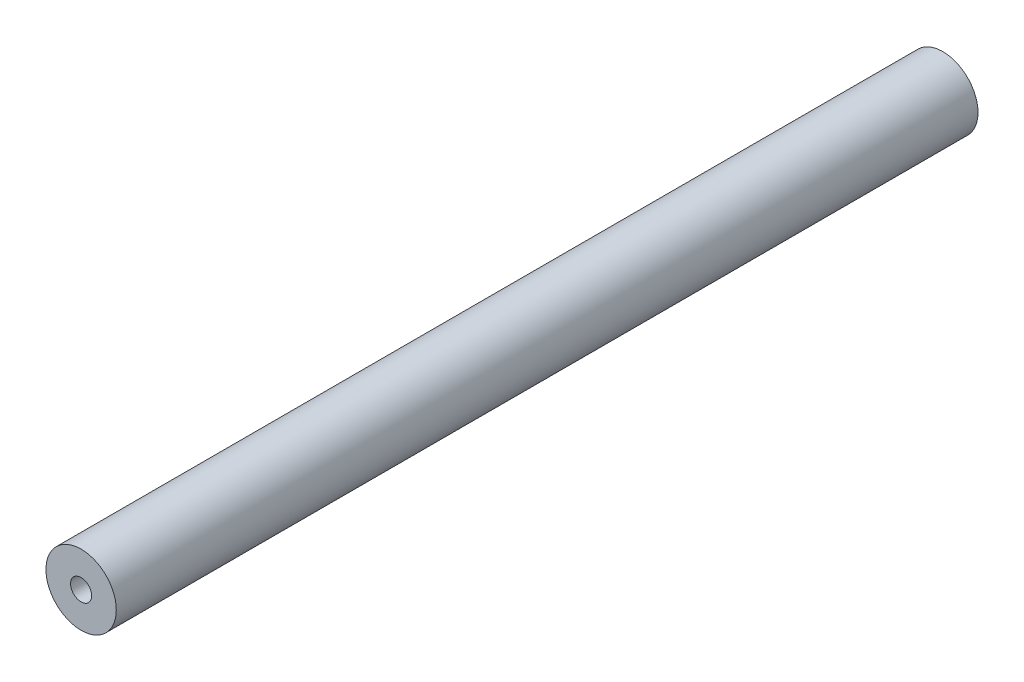
ISO-10303-21;
HEADER;
FILE_DESCRIPTION(('STEP AP214'),'2;1');
FILE_NAME('part.step','',(''),(''),'','','');
FILE_SCHEMA(('AUTOMOTIVE_DESIGN { 1 0 10303 214 1 1 1 1 }'));
ENDSEC;
DATA;
#1=APPLICATION_CONTEXT('core data for automotive mechanical design processes');
#2=APPLICATION_PROTOCOL_DEFINITION('international standard','automotive_design',2000,#1);
#3=PRODUCT_CONTEXT('',#1,'mechanical');
#4=PRODUCT('Part','Part','',(#3));
#5=PRODUCT_RELATED_PRODUCT_CATEGORY('part','',(#4));
#6=PRODUCT_DEFINITION_FORMATION('','',#4);
#7=PRODUCT_DEFINITION_CONTEXT('part definition',#1,'design');
#8=PRODUCT_DEFINITION('design','',#6,#7);
#9=PRODUCT_DEFINITION_SHAPE('','',#8);
#10=(LENGTH_UNIT() NAMED_UNIT(*) SI_UNIT(.MILLI.,.METRE.));
#11=(NAMED_UNIT(*) PLANE_ANGLE_UNIT() SI_UNIT($,.RADIAN.));
#12=(NAMED_UNIT(*) SI_UNIT($,.STERADIAN.) SOLID_ANGLE_UNIT());
#13=UNCERTAINTY_MEASURE_WITH_UNIT(LENGTH_MEASURE(1.E-05),#10,'distance_accuracy_value','');
#14=(GEOMETRIC_REPRESENTATION_CONTEXT(3) GLOBAL_UNCERTAINTY_ASSIGNED_CONTEXT((#13)) GLOBAL_UNIT_ASSIGNED_CONTEXT((#10,
#11,#12)) REPRESENTATION_CONTEXT('',''));
#15=CARTESIAN_POINT('',(0.,0.,0.));
#16=DIRECTION('',(0.,0.,1.));
#17=DIRECTION('',(1.,0.,0.));
#18=AXIS2_PLACEMENT_3D('',#15,#16,#17);
#19=CARTESIAN_POINT('',(0.,0.,1347.5));
#20=DIRECTION('',(0.,0.,1.));
#21=DIRECTION('',(1.,0.,0.));
#22=AXIS2_PLACEMENT_3D('',#19,#20,#21);
#23=PLANE('',#22);
#24=CARTESIAN_POINT('',(0.,0.,1347.5));
#25=DIRECTION('',(0.,0.,1.));
#26=DIRECTION('',(1.,0.,0.));
#27=AXIS2_PLACEMENT_3D('',#24,#25,#26);
#28=CIRCLE('',#27,10.);
#29=CARTESIAN_POINT('',(10.,0.,1347.5));
#30=VERTEX_POINT('',#29);
#31=EDGE_CURVE('E10',#30,#30,#28,.T.);
#32=ORIENTED_EDGE('',*,*,#31,.T.);
#33=EDGE_LOOP('',(#32));
#34=FACE_BOUND('',#33,.T.);
#35=CARTESIAN_POINT('',(0.,0.,1347.5));
#36=DIRECTION('',(0.,0.,1.));
#37=DIRECTION('',(1.,0.,0.));
#38=AXIS2_PLACEMENT_3D('',#35,#36,#37);
#39=CIRCLE('',#38,3.);
#40=CARTESIAN_POINT('',(3.,0.,1347.5));
#41=VERTEX_POINT('',#40);
#42=EDGE_CURVE('E52',#41,#41,#39,.T.);
#43=ORIENTED_EDGE('',*,*,#42,.F.);
#44=EDGE_LOOP('',(#43));
#45=FACE_BOUND('',#44,.T.);
#46=ADVANCED_FACE('F41',(#34,#45),#23,.T.);
#47=CARTESIAN_POINT('',(0.,0.,1102.5));
#48=DIRECTION('',(0.,0.,1.));
#49=DIRECTION('',(1.,0.,0.));
#50=AXIS2_PLACEMENT_3D('',#47,#48,#49);
#51=PLANE('',#50);
#52=CARTESIAN_POINT('',(0.,0.,1102.5));
#53=DIRECTION('',(0.,0.,1.));
#54=DIRECTION('',(1.,0.,0.));
#55=AXIS2_PLACEMENT_3D('',#52,#53,#54);
#56=CIRCLE('',#55,10.);
#57=CARTESIAN_POINT('',(10.,0.,1102.5));
#58=VERTEX_POINT('',#57);
#59=EDGE_CURVE('E45',#58,#58,#56,.T.);
#60=ORIENTED_EDGE('',*,*,#59,.F.);
#61=EDGE_LOOP('',(#60));
#62=FACE_BOUND('',#61,.T.);
#63=CARTESIAN_POINT('',(0.,0.,1102.5));
#64=DIRECTION('',(0.,0.,1.));
#65=DIRECTION('',(1.,0.,0.));
#66=AXIS2_PLACEMENT_3D('',#63,#64,#65);
#67=CIRCLE('',#66,3.);
#68=CARTESIAN_POINT('',(3.,0.,1102.5));
#69=VERTEX_POINT('',#68);
#70=EDGE_CURVE('E54',#69,#69,#67,.T.);
#71=ORIENTED_EDGE('',*,*,#70,.T.);
#72=EDGE_LOOP('',(#71));
#73=FACE_BOUND('',#72,.T.);
#74=ADVANCED_FACE('F64',(#62,#73),#51,.F.);
#75=CARTESIAN_POINT('',(0.,0.,1347.5));
#76=DIRECTION('',(0.,0.,-1.));
#77=DIRECTION('',(-1.,0.,0.));
#78=AXIS2_PLACEMENT_3D('',#75,#76,#77);
#79=CYLINDRICAL_SURFACE('',#78,10.);
#80=ORIENTED_EDGE('',*,*,#31,.F.);
#81=EDGE_LOOP('',(#80));
#82=FACE_BOUND('',#81,.T.);
#83=ORIENTED_EDGE('',*,*,#59,.T.);
#84=EDGE_LOOP('',(#83));
#85=FACE_BOUND('',#84,.T.);
#86=ADVANCED_FACE('F43',(#82,#85),#79,.T.);
#87=CARTESIAN_POINT('',(0.,0.,1347.5));
#88=DIRECTION('',(0.,0.,-1.));
#89=DIRECTION('',(-1.,0.,0.));
#90=AXIS2_PLACEMENT_3D('',#87,#88,#89);
#91=CYLINDRICAL_SURFACE('',#90,3.);
#92=ORIENTED_EDGE('',*,*,#42,.T.);
#93=EDGE_LOOP('',(#92));
#94=FACE_BOUND('',#93,.T.);
#95=ORIENTED_EDGE('',*,*,#70,.F.);
#96=EDGE_LOOP('',(#95));
#97=FACE_BOUND('',#96,.T.);
#98=ADVANCED_FACE('F60',(#94,#97),#91,.F.);
#99=CLOSED_SHELL('',(#46,#74,#86,#98));
#100=MANIFOLD_SOLID_BREP('B2',#99);
#101=ADVANCED_BREP_SHAPE_REPRESENTATION('',(#18,#100),#14);
#102=SHAPE_DEFINITION_REPRESENTATION(#9,#101);
ENDSEC;
END-ISO-10303-21;
